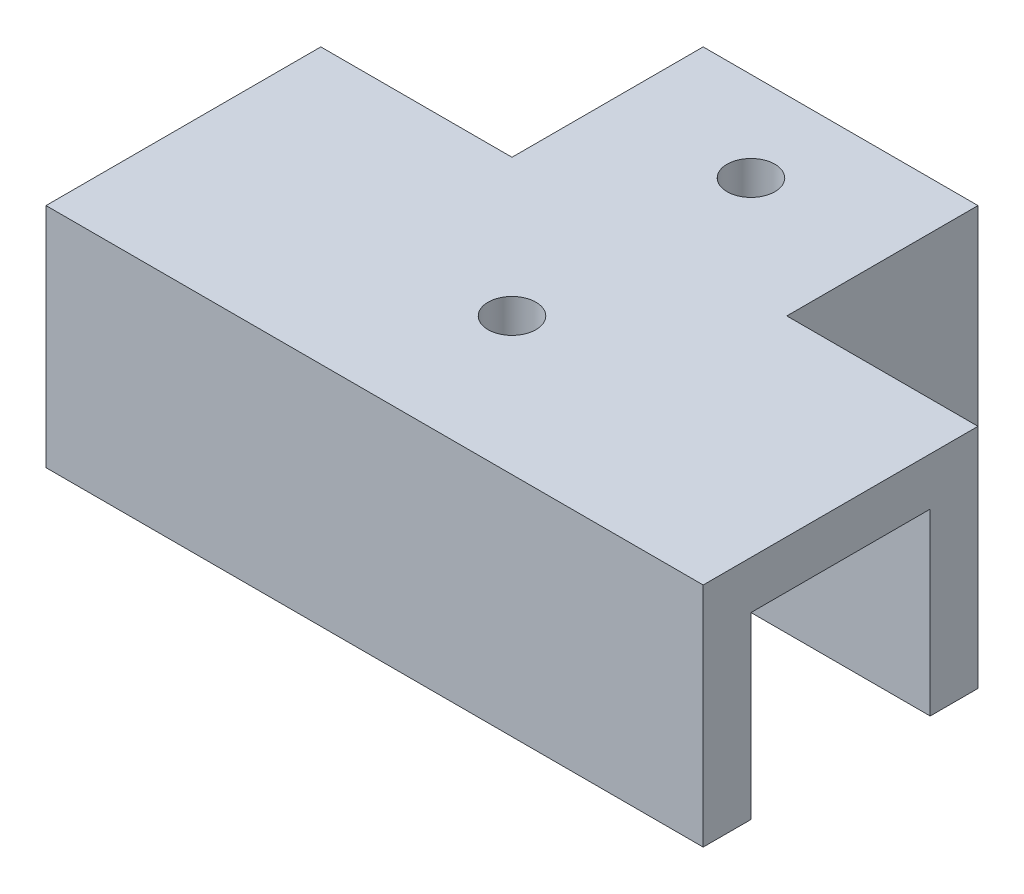
ISO-10303-21;
HEADER;
FILE_DESCRIPTION(('STEP AP214'),'2;1');
FILE_NAME('part.step','',(''),(''),'','','');
FILE_SCHEMA(('AUTOMOTIVE_DESIGN { 1 0 10303 214 1 1 1 1 }'));
ENDSEC;
DATA;
#1=APPLICATION_CONTEXT('core data for automotive mechanical design processes');
#2=APPLICATION_PROTOCOL_DEFINITION('international standard','automotive_design',2000,#1);
#3=PRODUCT_CONTEXT('',#1,'mechanical');
#4=PRODUCT('Part','Part','',(#3));
#5=PRODUCT_RELATED_PRODUCT_CATEGORY('part','',(#4));
#6=PRODUCT_DEFINITION_FORMATION('','',#4);
#7=PRODUCT_DEFINITION_CONTEXT('part definition',#1,'design');
#8=PRODUCT_DEFINITION('design','',#6,#7);
#9=PRODUCT_DEFINITION_SHAPE('','',#8);
#10=(LENGTH_UNIT() NAMED_UNIT(*) SI_UNIT(.MILLI.,.METRE.));
#11=(NAMED_UNIT(*) PLANE_ANGLE_UNIT() SI_UNIT($,.RADIAN.));
#12=(NAMED_UNIT(*) SI_UNIT($,.STERADIAN.) SOLID_ANGLE_UNIT());
#13=UNCERTAINTY_MEASURE_WITH_UNIT(LENGTH_MEASURE(1.E-05),#10,'distance_accuracy_value','');
#14=(GEOMETRIC_REPRESENTATION_CONTEXT(3) GLOBAL_UNCERTAINTY_ASSIGNED_CONTEXT((#13)) GLOBAL_UNIT_ASSIGNED_CONTEXT((#10,
#11,#12)) REPRESENTATION_CONTEXT('',''));
#15=CARTESIAN_POINT('',(0.,0.,0.));
#16=DIRECTION('',(0.,0.,1.));
#17=DIRECTION('',(1.,0.,0.));
#18=AXIS2_PLACEMENT_3D('',#15,#16,#17);
#19=CARTESIAN_POINT('',(0.,15.,0.));
#20=DIRECTION('',(0.,1.,0.));
#21=DIRECTION('',(0.,0.,1.));
#22=AXIS2_PLACEMENT_3D('',#19,#20,#21);
#23=PLANE('',#22);
#24=CARTESIAN_POINT('',(-1.92857142857143,15.,-24.3214285714286));
#25=DIRECTION('',(0.,1.,0.));
#26=DIRECTION('',(0.,0.,1.));
#27=AXIS2_PLACEMENT_3D('',#24,#25,#26);
#28=CIRCLE('',#27,2.);
#29=CARTESIAN_POINT('',(-1.92857142857143,15.,-22.3214285714286));
#30=VERTEX_POINT('',#29);
#31=EDGE_CURVE('E609',#30,#30,#28,.T.);
#32=ORIENTED_EDGE('',*,*,#31,.T.);
#33=EDGE_LOOP('',(#32));
#34=FACE_BOUND('',#33,.T.);
#35=CARTESIAN_POINT('',(-1.92857142857143,15.,-4.32142857142856));
#36=DIRECTION('',(0.,1.,0.));
#37=DIRECTION('',(0.,0.,1.));
#38=AXIS2_PLACEMENT_3D('',#35,#36,#37);
#39=CIRCLE('',#38,2.);
#40=CARTESIAN_POINT('',(-1.92857142857143,15.,-2.32142857142856));
#41=VERTEX_POINT('',#40);
#42=EDGE_CURVE('E628',#41,#41,#39,.T.);
#43=ORIENTED_EDGE('',*,*,#42,.T.);
#44=EDGE_LOOP('',(#43));
#45=FACE_BOUND('',#44,.T.);
#46=DIRECTION('',(0.,0.,1.));
#47=VECTOR('',#46,1.);
#48=CARTESIAN_POINT('',(25.5714285714286,15.,0.));
#49=LINE('',#48,#47);
#50=CARTESIAN_POINT('',(25.5714285714286,15.,-11.8214285714286));
#51=VERTEX_POINT('',#50);
#52=CARTESIAN_POINT('',(25.5714285714286,15.,3.17857142857145));
#53=VERTEX_POINT('',#52);
#54=EDGE_CURVE('E158',#51,#53,#49,.T.);
#55=ORIENTED_EDGE('',*,*,#54,.T.);
#56=DIRECTION('',(1.,0.,0.));
#57=VECTOR('',#56,1.);
#58=CARTESIAN_POINT('',(0.,15.,3.17857142857145));
#59=LINE('',#58,#57);
#60=CARTESIAN_POINT('',(-29.4285714285714,15.,3.17857142857145));
#61=VERTEX_POINT('',#60);
#62=EDGE_CURVE('E170',#61,#53,#59,.T.);
#63=ORIENTED_EDGE('',*,*,#62,.F.);
#64=DIRECTION('',(0.,0.,1.));
#65=VECTOR('',#64,1.);
#66=CARTESIAN_POINT('',(-29.4285714285714,15.,0.));
#67=LINE('',#66,#65);
#68=CARTESIAN_POINT('',(-29.4285714285714,15.,-11.8214285714286));
#69=VERTEX_POINT('',#68);
#70=EDGE_CURVE('E183',#69,#61,#67,.T.);
#71=ORIENTED_EDGE('',*,*,#70,.F.);
#72=DIRECTION('',(1.,0.,0.));
#73=VECTOR('',#72,1.);
#74=CARTESIAN_POINT('',(0.,15.,-11.8214285714286));
#75=LINE('',#74,#73);
#76=CARTESIAN_POINT('',(-9.42857142857143,15.,-11.8214285714286));
#77=VERTEX_POINT('',#76);
#78=EDGE_CURVE('E210',#69,#77,#75,.T.);
#79=ORIENTED_EDGE('',*,*,#78,.T.);
#80=DIRECTION('',(0.,0.,1.));
#81=VECTOR('',#80,1.);
#82=CARTESIAN_POINT('',(-9.42857142857143,15.,0.));
#83=LINE('',#82,#81);
#84=CARTESIAN_POINT('',(-9.42857142857143,15.,-31.8214285714286));
#85=VERTEX_POINT('',#84);
#86=EDGE_CURVE('E213',#85,#77,#83,.T.);
#87=ORIENTED_EDGE('',*,*,#86,.F.);
#88=DIRECTION('',(1.,0.,0.));
#89=VECTOR('',#88,1.);
#90=CARTESIAN_POINT('',(0.,15.,-31.8214285714286));
#91=LINE('',#90,#89);
#92=CARTESIAN_POINT('',(5.57142857142857,15.,-31.8214285714286));
#93=VERTEX_POINT('',#92);
#94=EDGE_CURVE('E62',#85,#93,#91,.T.);
#95=ORIENTED_EDGE('',*,*,#94,.T.);
#96=DIRECTION('',(0.,0.,1.));
#97=VECTOR('',#96,1.);
#98=CARTESIAN_POINT('',(5.57142857142857,15.,0.));
#99=LINE('',#98,#97);
#100=CARTESIAN_POINT('',(5.57142857142857,15.,-11.8214285714286));
#101=VERTEX_POINT('',#100);
#102=EDGE_CURVE('E57',#93,#101,#99,.T.);
#103=ORIENTED_EDGE('',*,*,#102,.T.);
#104=DIRECTION('',(1.,0.,0.));
#105=VECTOR('',#104,1.);
#106=CARTESIAN_POINT('',(0.,15.,-11.8214285714286));
#107=LINE('',#106,#105);
#108=EDGE_CURVE('E177',#101,#51,#107,.T.);
#109=ORIENTED_EDGE('',*,*,#108,.T.);
#110=EDGE_LOOP('',(#55,#63,#71,#79,#87,#95,#103,#109));
#111=FACE_BOUND('',#110,.T.);
#112=ADVANCED_FACE('F41',(#34,#45,#111),#23,.F.);
#113=CARTESIAN_POINT('',(-13.4285714285714,15.,0.));
#114=DIRECTION('',(-1.,0.,0.));
#115=DIRECTION('',(0.,0.,1.));
#116=AXIS2_PLACEMENT_3D('',#113,#114,#115);
#117=PLANE('',#116);
#118=DIRECTION('',(0.,0.,-1.));
#119=VECTOR('',#118,1.);
#120=CARTESIAN_POINT('',(-13.4285714285714,0.,0.));
#121=LINE('',#120,#119);
#122=CARTESIAN_POINT('',(-13.4285714285714,0.,-15.8214285714286));
#123=VERTEX_POINT('',#122);
#124=CARTESIAN_POINT('',(-13.4285714285714,0.,-31.8214285714286));
#125=VERTEX_POINT('',#124);
#126=EDGE_CURVE('E209',#123,#125,#121,.T.);
#127=ORIENTED_EDGE('',*,*,#126,.F.);
#128=DIRECTION('',(0.,-1.,0.));
#129=VECTOR('',#128,1.);
#130=CARTESIAN_POINT('',(-13.4285714285714,15.,-15.8214285714286));
#131=LINE('',#130,#129);
#132=CARTESIAN_POINT('',(-13.4285714285714,19.,-15.8214285714286));
#133=VERTEX_POINT('',#132);
#134=EDGE_CURVE('E11',#133,#123,#131,.T.);
#135=ORIENTED_EDGE('',*,*,#134,.F.);
#136=DIRECTION('',(0.,0.,1.));
#137=VECTOR('',#136,1.);
#138=CARTESIAN_POINT('',(-13.4285714285714,19.,0.));
#139=LINE('',#138,#137);
#140=CARTESIAN_POINT('',(-13.4285714285714,19.,-31.8214285714286));
#141=VERTEX_POINT('',#140);
#142=EDGE_CURVE('E337',#141,#133,#139,.T.);
#143=ORIENTED_EDGE('',*,*,#142,.F.);
#144=DIRECTION('',(0.,-1.,0.));
#145=VECTOR('',#144,1.);
#146=CARTESIAN_POINT('',(-13.4285714285714,15.,-31.8214285714286));
#147=LINE('',#146,#145);
#148=EDGE_CURVE('E218',#141,#125,#147,.T.);
#149=ORIENTED_EDGE('',*,*,#148,.T.);
#150=EDGE_LOOP('',(#127,#135,#143,#149));
#151=FACE_BOUND('',#150,.T.);
#152=ADVANCED_FACE('F43',(#151),#117,.T.);
#153=CARTESIAN_POINT('',(0.,15.,-15.8214285714286));
#154=DIRECTION('',(0.,0.,-1.));
#155=DIRECTION('',(-1.,0.,0.));
#156=AXIS2_PLACEMENT_3D('',#153,#154,#155);
#157=PLANE('',#156);
#158=DIRECTION('',(1.,0.,0.));
#159=VECTOR('',#158,1.);
#160=CARTESIAN_POINT('',(0.,0.,-15.8214285714286));
#161=LINE('',#160,#159);
#162=CARTESIAN_POINT('',(-29.4285714285714,0.,-15.8214285714286));
#163=VERTEX_POINT('',#162);
#164=EDGE_CURVE('E222',#163,#123,#161,.T.);
#165=ORIENTED_EDGE('',*,*,#164,.F.);
#166=DIRECTION('',(0.,-1.,0.));
#167=VECTOR('',#166,1.);
#168=CARTESIAN_POINT('',(-29.4285714285714,15.,-15.8214285714286));
#169=LINE('',#168,#167);
#170=CARTESIAN_POINT('',(-29.4285714285714,19.,-15.8214285714286));
#171=VERTEX_POINT('',#170);
#172=EDGE_CURVE('E50',#171,#163,#169,.T.);
#173=ORIENTED_EDGE('',*,*,#172,.F.);
#174=DIRECTION('',(1.,0.,0.));
#175=VECTOR('',#174,1.);
#176=CARTESIAN_POINT('',(0.,19.,-15.8214285714286));
#177=LINE('',#176,#175);
#178=EDGE_CURVE('E268',#171,#133,#177,.T.);
#179=ORIENTED_EDGE('',*,*,#178,.T.);
#180=ORIENTED_EDGE('',*,*,#134,.T.);
#181=EDGE_LOOP('',(#165,#173,#179,#180));
#182=FACE_BOUND('',#181,.T.);
#183=ADVANCED_FACE('F266',(#182),#157,.T.);
#184=CARTESIAN_POINT('',(-29.4285714285714,15.,0.));
#185=DIRECTION('',(1.,0.,0.));
#186=DIRECTION('',(0.,0.,-1.));
#187=AXIS2_PLACEMENT_3D('',#184,#185,#186);
#188=PLANE('',#187);
#189=DIRECTION('',(0.,0.,1.));
#190=VECTOR('',#189,1.);
#191=CARTESIAN_POINT('',(-29.4285714285714,0.,0.));
#192=LINE('',#191,#190);
#193=CARTESIAN_POINT('',(-29.4285714285714,0.,-11.8214285714286));
#194=VERTEX_POINT('',#193);
#195=EDGE_CURVE('E226',#163,#194,#192,.T.);
#196=ORIENTED_EDGE('',*,*,#195,.T.);
#197=DIRECTION('',(0.,-1.,0.));
#198=VECTOR('',#197,1.);
#199=CARTESIAN_POINT('',(-29.4285714285714,15.,-11.8214285714286));
#200=LINE('',#199,#198);
#201=EDGE_CURVE('E248',#69,#194,#200,.T.);
#202=ORIENTED_EDGE('',*,*,#201,.F.);
#203=ORIENTED_EDGE('',*,*,#70,.T.);
#204=DIRECTION('',(0.,-1.,0.));
#205=VECTOR('',#204,1.);
#206=CARTESIAN_POINT('',(-29.4285714285714,15.,3.17857142857145));
#207=LINE('',#206,#205);
#208=CARTESIAN_POINT('',(-29.4285714285714,0.,3.17857142857145));
#209=VERTEX_POINT('',#208);
#210=EDGE_CURVE('E167',#61,#209,#207,.T.);
#211=ORIENTED_EDGE('',*,*,#210,.T.);
#212=DIRECTION('',(0.,0.,1.));
#213=VECTOR('',#212,1.);
#214=CARTESIAN_POINT('',(-29.4285714285714,0.,0.));
#215=LINE('',#214,#213);
#216=CARTESIAN_POINT('',(-29.4285714285714,0.,7.17857142857145));
#217=VERTEX_POINT('',#216);
#218=EDGE_CURVE('E613',#209,#217,#215,.T.);
#219=ORIENTED_EDGE('',*,*,#218,.T.);
#220=DIRECTION('',(0.,-1.,0.));
#221=VECTOR('',#220,1.);
#222=CARTESIAN_POINT('',(-29.4285714285714,19.,7.17857142857145));
#223=LINE('',#222,#221);
#224=CARTESIAN_POINT('',(-29.4285714285714,19.,7.17857142857145));
#225=VERTEX_POINT('',#224);
#226=EDGE_CURVE('E197',#225,#217,#223,.T.);
#227=ORIENTED_EDGE('',*,*,#226,.F.);
#228=DIRECTION('',(0.,0.,1.));
#229=VECTOR('',#228,1.);
#230=CARTESIAN_POINT('',(-29.4285714285714,19.,0.));
#231=LINE('',#230,#229);
#232=EDGE_CURVE('E258',#171,#225,#231,.T.);
#233=ORIENTED_EDGE('',*,*,#232,.F.);
#234=ORIENTED_EDGE('',*,*,#172,.T.);
#235=EDGE_LOOP('',(#196,#202,#203,#211,#219,#227,#233,#234));
#236=FACE_BOUND('',#235,.T.);
#237=ADVANCED_FACE('F255',(#236),#188,.F.);
#238=CARTESIAN_POINT('',(0.,15.,-11.8214285714286));
#239=DIRECTION('',(0.,0.,-1.));
#240=DIRECTION('',(-1.,0.,0.));
#241=AXIS2_PLACEMENT_3D('',#238,#239,#240);
#242=PLANE('',#241);
#243=DIRECTION('',(1.,0.,0.));
#244=VECTOR('',#243,1.);
#245=CARTESIAN_POINT('',(0.,0.,-11.8214285714286));
#246=LINE('',#245,#244);
#247=CARTESIAN_POINT('',(-9.42857142857143,0.,-11.8214285714286));
#248=VERTEX_POINT('',#247);
#249=EDGE_CURVE('E229',#194,#248,#246,.T.);
#250=ORIENTED_EDGE('',*,*,#249,.T.);
#251=DIRECTION('',(0.,-1.,0.));
#252=VECTOR('',#251,1.);
#253=CARTESIAN_POINT('',(-9.42857142857143,15.,-11.8214285714286));
#254=LINE('',#253,#252);
#255=EDGE_CURVE('E245',#77,#248,#254,.T.);
#256=ORIENTED_EDGE('',*,*,#255,.F.);
#257=ORIENTED_EDGE('',*,*,#78,.F.);
#258=ORIENTED_EDGE('',*,*,#201,.T.);
#259=EDGE_LOOP('',(#250,#256,#257,#258));
#260=FACE_BOUND('',#259,.T.);
#261=ADVANCED_FACE('F281',(#260),#242,.F.);
#262=CARTESIAN_POINT('',(-9.42857142857143,15.,0.));
#263=DIRECTION('',(1.,0.,0.));
#264=DIRECTION('',(0.,0.,-1.));
#265=AXIS2_PLACEMENT_3D('',#262,#263,#264);
#266=PLANE('',#265);
#267=DIRECTION('',(0.,0.,1.));
#268=VECTOR('',#267,1.);
#269=CARTESIAN_POINT('',(-9.42857142857143,0.,0.));
#270=LINE('',#269,#268);
#271=CARTESIAN_POINT('',(-9.42857142857143,0.,-31.8214285714286));
#272=VERTEX_POINT('',#271);
#273=EDGE_CURVE('E233',#272,#248,#270,.T.);
#274=ORIENTED_EDGE('',*,*,#273,.F.);
#275=DIRECTION('',(0.,-1.,0.));
#276=VECTOR('',#275,1.);
#277=CARTESIAN_POINT('',(-9.42857142857143,15.,-31.8214285714286));
#278=LINE('',#277,#276);
#279=EDGE_CURVE('E242',#85,#272,#278,.T.);
#280=ORIENTED_EDGE('',*,*,#279,.F.);
#281=ORIENTED_EDGE('',*,*,#86,.T.);
#282=ORIENTED_EDGE('',*,*,#255,.T.);
#283=EDGE_LOOP('',(#274,#280,#281,#282));
#284=FACE_BOUND('',#283,.T.);
#285=ADVANCED_FACE('F277',(#284),#266,.T.);
#286=CARTESIAN_POINT('',(0.,15.,-31.8214285714286));
#287=DIRECTION('',(0.,0.,1.));
#288=DIRECTION('',(1.,0.,0.));
#289=AXIS2_PLACEMENT_3D('',#286,#287,#288);
#290=PLANE('',#289);
#291=DIRECTION('',(-1.,0.,0.));
#292=VECTOR('',#291,1.);
#293=CARTESIAN_POINT('',(0.,0.,-31.8214285714286));
#294=LINE('',#293,#292);
#295=EDGE_CURVE('E214',#272,#125,#294,.T.);
#296=ORIENTED_EDGE('',*,*,#295,.T.);
#297=ORIENTED_EDGE('',*,*,#148,.F.);
#298=DIRECTION('',(1.,0.,0.));
#299=VECTOR('',#298,1.);
#300=CARTESIAN_POINT('',(0.,19.,-31.8214285714286));
#301=LINE('',#300,#299);
#302=CARTESIAN_POINT('',(9.57142857142857,19.,-31.8214285714286));
#303=VERTEX_POINT('',#302);
#304=EDGE_CURVE('E333',#141,#303,#301,.T.);
#305=ORIENTED_EDGE('',*,*,#304,.T.);
#306=DIRECTION('',(0.,-1.,0.));
#307=VECTOR('',#306,1.);
#308=CARTESIAN_POINT('',(9.57142857142857,19.,-31.8214285714286));
#309=LINE('',#308,#307);
#310=CARTESIAN_POINT('',(9.57142857142857,0.,-31.8214285714286));
#311=VERTEX_POINT('',#310);
#312=EDGE_CURVE('E200',#303,#311,#309,.T.);
#313=ORIENTED_EDGE('',*,*,#312,.T.);
#314=DIRECTION('',(1.,0.,0.));
#315=VECTOR('',#314,1.);
#316=CARTESIAN_POINT('',(0.,0.,-31.8214285714285));
#317=LINE('',#316,#315);
#318=CARTESIAN_POINT('',(5.57142857142857,0.,-31.8214285714286));
#319=VERTEX_POINT('',#318);
#320=EDGE_CURVE('E287',#319,#311,#317,.T.);
#321=ORIENTED_EDGE('',*,*,#320,.F.);
#322=DIRECTION('',(0.,-1.,0.));
#323=VECTOR('',#322,1.);
#324=CARTESIAN_POINT('',(5.57142857142857,15.,-31.8214285714286));
#325=LINE('',#324,#323);
#326=EDGE_CURVE('E185',#93,#319,#325,.T.);
#327=ORIENTED_EDGE('',*,*,#326,.F.);
#328=ORIENTED_EDGE('',*,*,#94,.F.);
#329=ORIENTED_EDGE('',*,*,#279,.T.);
#330=EDGE_LOOP('',(#296,#297,#305,#313,#321,#327,#328,#329));
#331=FACE_BOUND('',#330,.T.);
#332=ADVANCED_FACE('F284',(#331),#290,.F.);
#333=CARTESIAN_POINT('',(0.,0.,0.));
#334=DIRECTION('',(0.,1.,0.));
#335=DIRECTION('',(0.,0.,1.));
#336=AXIS2_PLACEMENT_3D('',#333,#334,#335);
#337=PLANE('',#336);
#338=ORIENTED_EDGE('',*,*,#126,.T.);
#339=ORIENTED_EDGE('',*,*,#295,.F.);
#340=ORIENTED_EDGE('',*,*,#273,.T.);
#341=ORIENTED_EDGE('',*,*,#249,.F.);
#342=ORIENTED_EDGE('',*,*,#195,.F.);
#343=ORIENTED_EDGE('',*,*,#164,.T.);
#344=EDGE_LOOP('',(#338,#339,#340,#341,#342,#343));
#345=FACE_BOUND('',#344,.T.);
#346=ADVANCED_FACE('F265',(#345),#337,.F.);
#347=CARTESIAN_POINT('',(25.5714285714286,19.,0.));
#348=DIRECTION('',(1.,0.,0.));
#349=DIRECTION('',(0.,0.,-1.));
#350=AXIS2_PLACEMENT_3D('',#347,#348,#349);
#351=PLANE('',#350);
#352=ORIENTED_EDGE('',*,*,#54,.F.);
#353=DIRECTION('',(0.,-1.,0.));
#354=VECTOR('',#353,1.);
#355=CARTESIAN_POINT('',(25.5714285714286,15.,-11.8214285714286));
#356=LINE('',#355,#354);
#357=CARTESIAN_POINT('',(25.5714285714286,0.,-11.8214285714286));
#358=VERTEX_POINT('',#357);
#359=EDGE_CURVE('E179',#51,#358,#356,.T.);
#360=ORIENTED_EDGE('',*,*,#359,.T.);
#361=DIRECTION('',(0.,0.,-1.));
#362=VECTOR('',#361,1.);
#363=CARTESIAN_POINT('',(25.5714285714286,0.,0.));
#364=LINE('',#363,#362);
#365=CARTESIAN_POINT('',(25.5714285714286,0.,-15.8214285714286));
#366=VERTEX_POINT('',#365);
#367=EDGE_CURVE('E306',#358,#366,#364,.T.);
#368=ORIENTED_EDGE('',*,*,#367,.T.);
#369=DIRECTION('',(0.,-1.,0.));
#370=VECTOR('',#369,1.);
#371=CARTESIAN_POINT('',(25.5714285714286,19.,-15.8214285714286));
#372=LINE('',#371,#370);
#373=CARTESIAN_POINT('',(25.5714285714286,19.,-15.8214285714286));
#374=VERTEX_POINT('',#373);
#375=EDGE_CURVE('E206',#374,#366,#372,.T.);
#376=ORIENTED_EDGE('',*,*,#375,.F.);
#377=DIRECTION('',(0.,0.,1.));
#378=VECTOR('',#377,1.);
#379=CARTESIAN_POINT('',(25.5714285714286,19.,0.));
#380=LINE('',#379,#378);
#381=CARTESIAN_POINT('',(25.5714285714286,19.,7.17857142857145));
#382=VERTEX_POINT('',#381);
#383=EDGE_CURVE('E193',#374,#382,#380,.T.);
#384=ORIENTED_EDGE('',*,*,#383,.T.);
#385=DIRECTION('',(0.,-1.,0.));
#386=VECTOR('',#385,1.);
#387=CARTESIAN_POINT('',(25.5714285714286,19.,7.17857142857145));
#388=LINE('',#387,#386);
#389=CARTESIAN_POINT('',(25.5714285714286,0.,7.17857142857145));
#390=VERTEX_POINT('',#389);
#391=EDGE_CURVE('E194',#382,#390,#388,.T.);
#392=ORIENTED_EDGE('',*,*,#391,.T.);
#393=DIRECTION('',(0.,0.,1.));
#394=VECTOR('',#393,1.);
#395=CARTESIAN_POINT('',(25.5714285714286,0.,0.));
#396=LINE('',#395,#394);
#397=CARTESIAN_POINT('',(25.5714285714286,0.,3.17857142857145));
#398=VERTEX_POINT('',#397);
#399=EDGE_CURVE('E161',#398,#390,#396,.T.);
#400=ORIENTED_EDGE('',*,*,#399,.F.);
#401=DIRECTION('',(0.,-1.,0.));
#402=VECTOR('',#401,1.);
#403=CARTESIAN_POINT('',(25.5714285714286,15.,3.17857142857145));
#404=LINE('',#403,#402);
#405=EDGE_CURVE('E153',#53,#398,#404,.T.);
#406=ORIENTED_EDGE('',*,*,#405,.F.);
#407=EDGE_LOOP('',(#352,#360,#368,#376,#384,#392,#400,#406));
#408=FACE_BOUND('',#407,.T.);
#409=ADVANCED_FACE('F155',(#408),#351,.T.);
#410=CARTESIAN_POINT('',(0.,19.,-15.8214285714286));
#411=DIRECTION('',(0.,0.,-1.));
#412=DIRECTION('',(-1.,0.,0.));
#413=AXIS2_PLACEMENT_3D('',#410,#411,#412);
#414=PLANE('',#413);
#415=ORIENTED_EDGE('',*,*,#375,.T.);
#416=DIRECTION('',(1.,0.,0.));
#417=VECTOR('',#416,1.);
#418=CARTESIAN_POINT('',(0.,0.,-15.8214285714286));
#419=LINE('',#418,#417);
#420=CARTESIAN_POINT('',(9.57142857142857,0.,-15.8214285714286));
#421=VERTEX_POINT('',#420);
#422=EDGE_CURVE('E310',#421,#366,#419,.T.);
#423=ORIENTED_EDGE('',*,*,#422,.F.);
#424=DIRECTION('',(0.,-1.,0.));
#425=VECTOR('',#424,1.);
#426=CARTESIAN_POINT('',(9.57142857142857,19.,-15.8214285714286));
#427=LINE('',#426,#425);
#428=CARTESIAN_POINT('',(9.57142857142857,19.,-15.8214285714286));
#429=VERTEX_POINT('',#428);
#430=EDGE_CURVE('E203',#429,#421,#427,.T.);
#431=ORIENTED_EDGE('',*,*,#430,.F.);
#432=EDGE_CURVE('E325',#429,#374,#177,.T.);
#433=ORIENTED_EDGE('',*,*,#432,.T.);
#434=EDGE_LOOP('',(#415,#423,#431,#433));
#435=FACE_BOUND('',#434,.T.);
#436=ADVANCED_FACE('F354',(#435),#414,.T.);
#437=CARTESIAN_POINT('',(9.57142857142857,19.,0.));
#438=DIRECTION('',(1.,0.,0.));
#439=DIRECTION('',(0.,0.,-1.));
#440=AXIS2_PLACEMENT_3D('',#437,#438,#439);
#441=PLANE('',#440);
#442=ORIENTED_EDGE('',*,*,#430,.T.);
#443=DIRECTION('',(0.,0.,1.));
#444=VECTOR('',#443,1.);
#445=CARTESIAN_POINT('',(9.57142857142857,0.,0.));
#446=LINE('',#445,#444);
#447=EDGE_CURVE('E314',#311,#421,#446,.T.);
#448=ORIENTED_EDGE('',*,*,#447,.F.);
#449=ORIENTED_EDGE('',*,*,#312,.F.);
#450=DIRECTION('',(0.,0.,1.));
#451=VECTOR('',#450,1.);
#452=CARTESIAN_POINT('',(9.57142857142857,19.,0.));
#453=LINE('',#452,#451);
#454=EDGE_CURVE('E329',#303,#429,#453,.T.);
#455=ORIENTED_EDGE('',*,*,#454,.T.);
#456=EDGE_LOOP('',(#442,#448,#449,#455));
#457=FACE_BOUND('',#456,.T.);
#458=ADVANCED_FACE('F358',(#457),#441,.T.);
#459=CARTESIAN_POINT('',(0.,19.,7.17857142857145));
#460=DIRECTION('',(0.,0.,-1.));
#461=DIRECTION('',(-1.,0.,0.));
#462=AXIS2_PLACEMENT_3D('',#459,#460,#461);
#463=PLANE('',#462);
#464=ORIENTED_EDGE('',*,*,#226,.T.);
#465=DIRECTION('',(1.,0.,0.));
#466=VECTOR('',#465,1.);
#467=CARTESIAN_POINT('',(0.,0.,7.17857142857145));
#468=LINE('',#467,#466);
#469=EDGE_CURVE('E174',#217,#390,#468,.T.);
#470=ORIENTED_EDGE('',*,*,#469,.T.);
#471=ORIENTED_EDGE('',*,*,#391,.F.);
#472=DIRECTION('',(1.,0.,0.));
#473=VECTOR('',#472,1.);
#474=CARTESIAN_POINT('',(0.,19.,7.17857142857145));
#475=LINE('',#474,#473);
#476=EDGE_CURVE('E188',#225,#382,#475,.T.);
#477=ORIENTED_EDGE('',*,*,#476,.F.);
#478=EDGE_LOOP('',(#464,#470,#471,#477));
#479=FACE_BOUND('',#478,.T.);
#480=ADVANCED_FACE('F350',(#479),#463,.F.);
#481=CARTESIAN_POINT('',(0.,19.,0.));
#482=DIRECTION('',(0.,1.,0.));
#483=DIRECTION('',(0.,0.,1.));
#484=AXIS2_PLACEMENT_3D('',#481,#482,#483);
#485=PLANE('',#484);
#486=CARTESIAN_POINT('',(-1.92857142857143,19.,-24.3214285714286));
#487=DIRECTION('',(0.,1.,0.));
#488=DIRECTION('',(0.,0.,1.));
#489=AXIS2_PLACEMENT_3D('',#486,#487,#488);
#490=CIRCLE('',#489,2.);
#491=CARTESIAN_POINT('',(-1.92857142857143,19.,-22.3214285714286));
#492=VERTEX_POINT('',#491);
#493=EDGE_CURVE('E615',#492,#492,#490,.T.);
#494=ORIENTED_EDGE('',*,*,#493,.F.);
#495=EDGE_LOOP('',(#494));
#496=FACE_BOUND('',#495,.T.);
#497=CARTESIAN_POINT('',(-1.92857142857143,19.,-4.32142857142856));
#498=DIRECTION('',(0.,1.,0.));
#499=DIRECTION('',(0.,0.,1.));
#500=AXIS2_PLACEMENT_3D('',#497,#498,#499);
#501=CIRCLE('',#500,2.);
#502=CARTESIAN_POINT('',(-1.92857142857143,19.,-2.32142857142856));
#503=VERTEX_POINT('',#502);
#504=EDGE_CURVE('E624',#503,#503,#501,.T.);
#505=ORIENTED_EDGE('',*,*,#504,.F.);
#506=EDGE_LOOP('',(#505));
#507=FACE_BOUND('',#506,.T.);
#508=ORIENTED_EDGE('',*,*,#383,.F.);
#509=ORIENTED_EDGE('',*,*,#432,.F.);
#510=ORIENTED_EDGE('',*,*,#454,.F.);
#511=ORIENTED_EDGE('',*,*,#304,.F.);
#512=ORIENTED_EDGE('',*,*,#142,.T.);
#513=ORIENTED_EDGE('',*,*,#178,.F.);
#514=ORIENTED_EDGE('',*,*,#232,.T.);
#515=ORIENTED_EDGE('',*,*,#476,.T.);
#516=EDGE_LOOP('',(#508,#509,#510,#511,#512,#513,#514,#515));
#517=FACE_BOUND('',#516,.T.);
#518=ADVANCED_FACE('F346',(#496,#507,#517),#485,.T.);
#519=CARTESIAN_POINT('',(0.,15.,-11.8214285714286));
#520=DIRECTION('',(0.,0.,-1.));
#521=DIRECTION('',(-1.,0.,0.));
#522=AXIS2_PLACEMENT_3D('',#519,#520,#521);
#523=PLANE('',#522);
#524=DIRECTION('',(1.,0.,0.));
#525=VECTOR('',#524,1.);
#526=CARTESIAN_POINT('',(0.,0.,-11.8214285714286));
#527=LINE('',#526,#525);
#528=CARTESIAN_POINT('',(5.57142857142857,0.,-11.8214285714286));
#529=VERTEX_POINT('',#528);
#530=EDGE_CURVE('E166',#529,#358,#527,.T.);
#531=ORIENTED_EDGE('',*,*,#530,.T.);
#532=ORIENTED_EDGE('',*,*,#359,.F.);
#533=ORIENTED_EDGE('',*,*,#108,.F.);
#534=DIRECTION('',(0.,-1.,0.));
#535=VECTOR('',#534,1.);
#536=CARTESIAN_POINT('',(5.57142857142857,15.,-11.8214285714286));
#537=LINE('',#536,#535);
#538=EDGE_CURVE('E291',#101,#529,#537,.T.);
#539=ORIENTED_EDGE('',*,*,#538,.T.);
#540=EDGE_LOOP('',(#531,#532,#533,#539));
#541=FACE_BOUND('',#540,.T.);
#542=ADVANCED_FACE('F364',(#541),#523,.F.);
#543=CARTESIAN_POINT('',(5.57142857142857,15.,0.));
#544=DIRECTION('',(1.,0.,0.));
#545=DIRECTION('',(0.,0.,-1.));
#546=AXIS2_PLACEMENT_3D('',#543,#544,#545);
#547=PLANE('',#546);
#548=DIRECTION('',(0.,0.,1.));
#549=VECTOR('',#548,1.);
#550=CARTESIAN_POINT('',(5.57142857142857,0.,0.));
#551=LINE('',#550,#549);
#552=EDGE_CURVE('E300',#319,#529,#551,.T.);
#553=ORIENTED_EDGE('',*,*,#552,.T.);
#554=ORIENTED_EDGE('',*,*,#538,.F.);
#555=ORIENTED_EDGE('',*,*,#102,.F.);
#556=ORIENTED_EDGE('',*,*,#326,.T.);
#557=EDGE_LOOP('',(#553,#554,#555,#556));
#558=FACE_BOUND('',#557,.T.);
#559=ADVANCED_FACE('F293',(#558),#547,.F.);
#560=CARTESIAN_POINT('',(0.,0.,0.));
#561=DIRECTION('',(0.,1.,0.));
#562=DIRECTION('',(0.,0.,1.));
#563=AXIS2_PLACEMENT_3D('',#560,#561,#562);
#564=PLANE('',#563);
#565=ORIENTED_EDGE('',*,*,#530,.F.);
#566=ORIENTED_EDGE('',*,*,#552,.F.);
#567=ORIENTED_EDGE('',*,*,#320,.T.);
#568=ORIENTED_EDGE('',*,*,#447,.T.);
#569=ORIENTED_EDGE('',*,*,#422,.T.);
#570=ORIENTED_EDGE('',*,*,#367,.F.);
#571=EDGE_LOOP('',(#565,#566,#567,#568,#569,#570));
#572=FACE_BOUND('',#571,.T.);
#573=ADVANCED_FACE('F362',(#572),#564,.F.);
#574=CARTESIAN_POINT('',(0.,15.,3.17857142857145));
#575=DIRECTION('',(0.,0.,-1.));
#576=DIRECTION('',(-1.,0.,0.));
#577=AXIS2_PLACEMENT_3D('',#574,#575,#576);
#578=PLANE('',#577);
#579=DIRECTION('',(1.,0.,0.));
#580=VECTOR('',#579,1.);
#581=CARTESIAN_POINT('',(0.,0.,3.17857142857145));
#582=LINE('',#581,#580);
#583=EDGE_CURVE('E607',#209,#398,#582,.T.);
#584=ORIENTED_EDGE('',*,*,#583,.F.);
#585=ORIENTED_EDGE('',*,*,#210,.F.);
#586=ORIENTED_EDGE('',*,*,#62,.T.);
#587=ORIENTED_EDGE('',*,*,#405,.T.);
#588=EDGE_LOOP('',(#584,#585,#586,#587));
#589=FACE_BOUND('',#588,.T.);
#590=ADVANCED_FACE('F171',(#589),#578,.T.);
#591=CARTESIAN_POINT('',(0.,0.,0.));
#592=DIRECTION('',(0.,1.,0.));
#593=DIRECTION('',(0.,0.,1.));
#594=AXIS2_PLACEMENT_3D('',#591,#592,#593);
#595=PLANE('',#594);
#596=ORIENTED_EDGE('',*,*,#399,.T.);
#597=ORIENTED_EDGE('',*,*,#469,.F.);
#598=ORIENTED_EDGE('',*,*,#218,.F.);
#599=ORIENTED_EDGE('',*,*,#583,.T.);
#600=EDGE_LOOP('',(#596,#597,#598,#599));
#601=FACE_BOUND('',#600,.T.);
#602=ADVANCED_FACE('F460',(#601),#595,.F.);
#603=CARTESIAN_POINT('',(-1.92857142857143,15.,-4.32142857142856));
#604=DIRECTION('',(0.,1.,0.));
#605=DIRECTION('',(0.,0.,1.));
#606=AXIS2_PLACEMENT_3D('',#603,#604,#605);
#607=CYLINDRICAL_SURFACE('',#606,2.);
#608=ORIENTED_EDGE('',*,*,#42,.F.);
#609=EDGE_LOOP('',(#608));
#610=FACE_BOUND('',#609,.T.);
#611=ORIENTED_EDGE('',*,*,#504,.T.);
#612=EDGE_LOOP('',(#611));
#613=FACE_BOUND('',#612,.T.);
#614=ADVANCED_FACE('F455',(#610,#613),#607,.F.);
#615=CARTESIAN_POINT('',(-1.92857142857143,15.,-24.3214285714286));
#616=DIRECTION('',(0.,1.,0.));
#617=DIRECTION('',(0.,0.,1.));
#618=AXIS2_PLACEMENT_3D('',#615,#616,#617);
#619=CYLINDRICAL_SURFACE('',#618,2.);
#620=ORIENTED_EDGE('',*,*,#31,.F.);
#621=EDGE_LOOP('',(#620));
#622=FACE_BOUND('',#621,.T.);
#623=ORIENTED_EDGE('',*,*,#493,.T.);
#624=EDGE_LOOP('',(#623));
#625=FACE_BOUND('',#624,.T.);
#626=ADVANCED_FACE('F459',(#622,#625),#619,.F.);
#627=CLOSED_SHELL('',(#112,#152,#183,#237,#261,#285,#332,#346,#409,#436,#458,#480,#518,#542,
#559,#573,#590,#602,#614,#626));
#628=MANIFOLD_SOLID_BREP('B2',#627);
#629=ADVANCED_BREP_SHAPE_REPRESENTATION('',(#18,#628),#14);
#630=SHAPE_DEFINITION_REPRESENTATION(#9,#629);
ENDSEC;
END-ISO-10303-21;
